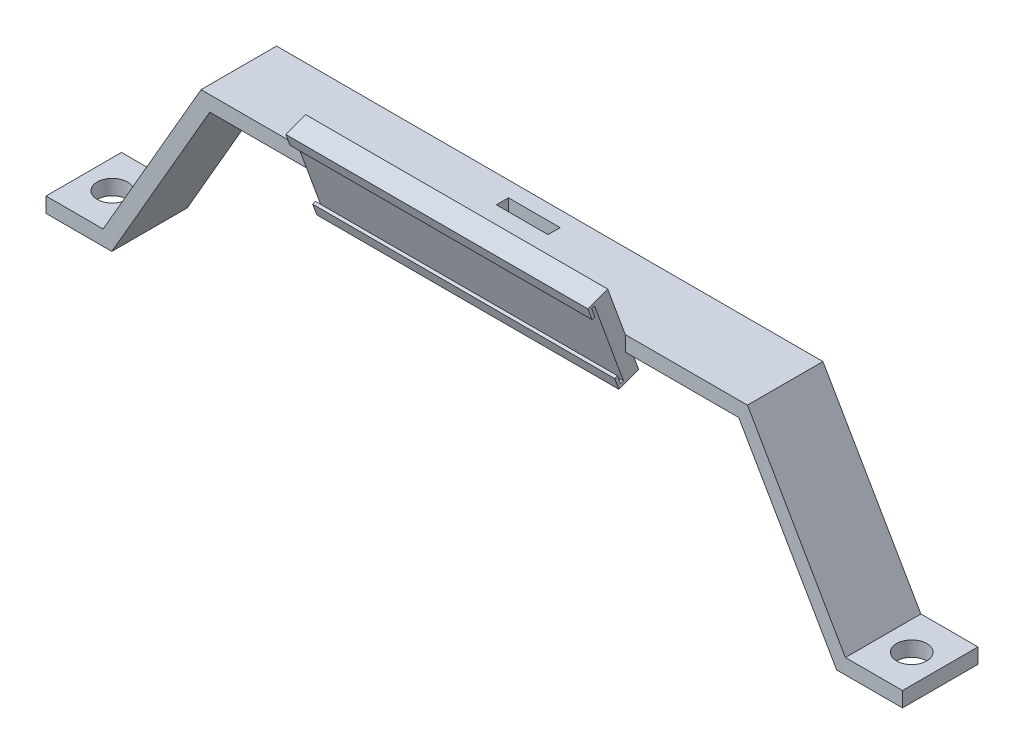
ISO-10303-21;
HEADER;
FILE_DESCRIPTION(('STEP AP214'),'2;1');
FILE_NAME('part.step','',(''),(''),'','','');
FILE_SCHEMA(('AUTOMOTIVE_DESIGN { 1 0 10303 214 1 1 1 1 }'));
ENDSEC;
DATA;
#1=APPLICATION_CONTEXT('core data for automotive mechanical design processes');
#2=APPLICATION_PROTOCOL_DEFINITION('international standard','automotive_design',2000,#1);
#3=PRODUCT_CONTEXT('',#1,'mechanical');
#4=PRODUCT('Part','Part','',(#3));
#5=PRODUCT_RELATED_PRODUCT_CATEGORY('part','',(#4));
#6=PRODUCT_DEFINITION_FORMATION('','',#4);
#7=PRODUCT_DEFINITION_CONTEXT('part definition',#1,'design');
#8=PRODUCT_DEFINITION('design','',#6,#7);
#9=PRODUCT_DEFINITION_SHAPE('','',#8);
#10=(LENGTH_UNIT() NAMED_UNIT(*) SI_UNIT(.MILLI.,.METRE.));
#11=(NAMED_UNIT(*) PLANE_ANGLE_UNIT() SI_UNIT($,.RADIAN.));
#12=(NAMED_UNIT(*) SI_UNIT($,.STERADIAN.) SOLID_ANGLE_UNIT());
#13=UNCERTAINTY_MEASURE_WITH_UNIT(LENGTH_MEASURE(1.E-05),#10,'distance_accuracy_value','');
#14=(GEOMETRIC_REPRESENTATION_CONTEXT(3) GLOBAL_UNCERTAINTY_ASSIGNED_CONTEXT((#13)) GLOBAL_UNIT_ASSIGNED_CONTEXT((#10,
#11,#12)) REPRESENTATION_CONTEXT('',''));
#15=CARTESIAN_POINT('',(0.,0.,0.));
#16=DIRECTION('',(0.,0.,1.));
#17=DIRECTION('',(1.,0.,0.));
#18=AXIS2_PLACEMENT_3D('',#15,#16,#17);
#19=CARTESIAN_POINT('',(0.,56.1666048466525,25.));
#20=DIRECTION('',(0.,1.,0.));
#21=DIRECTION('',(0.,0.,1.));
#22=AXIS2_PLACEMENT_3D('',#19,#20,#21);
#23=PLANE('',#22);
#24=DIRECTION('',(1.,0.,0.));
#25=VECTOR('',#24,1.);
#26=CARTESIAN_POINT('',(0.,56.1666048466525,9.1285851237294));
#27=LINE('',#26,#25);
#28=CARTESIAN_POINT('',(-8.54856177343624,56.1666048466525,9.1285851237294));
#29=VERTEX_POINT('',#28);
#30=CARTESIAN_POINT('',(8.54856177343624,56.1666048466525,9.1285851237294));
#31=VERTEX_POINT('',#30);
#32=EDGE_CURVE('E473',#29,#31,#27,.T.);
#33=ORIENTED_EDGE('',*,*,#32,.T.);
#34=DIRECTION('',(0.,0.,-1.));
#35=VECTOR('',#34,1.);
#36=CARTESIAN_POINT('',(8.54856177343624,56.1666048466525,25.));
#37=LINE('',#36,#35);
#38=CARTESIAN_POINT('',(8.54856177343624,56.1666048466525,5.10791466769694));
#39=VERTEX_POINT('',#38);
#40=EDGE_CURVE('E476',#31,#39,#37,.T.);
#41=ORIENTED_EDGE('',*,*,#40,.T.);
#42=DIRECTION('',(-1.,0.,0.));
#43=VECTOR('',#42,1.);
#44=CARTESIAN_POINT('',(0.,56.1666048466525,5.10791466769694));
#45=LINE('',#44,#43);
#46=CARTESIAN_POINT('',(-8.54856177343624,56.1666048466525,5.10791466769694));
#47=VERTEX_POINT('',#46);
#48=EDGE_CURVE('E465',#39,#47,#45,.T.);
#49=ORIENTED_EDGE('',*,*,#48,.T.);
#50=DIRECTION('',(0.,0.,1.));
#51=VECTOR('',#50,1.);
#52=CARTESIAN_POINT('',(-8.54856177343624,56.1666048466525,25.));
#53=LINE('',#52,#51);
#54=EDGE_CURVE('E470',#47,#29,#53,.T.);
#55=ORIENTED_EDGE('',*,*,#54,.T.);
#56=EDGE_LOOP('',(#33,#41,#49,#55));
#57=FACE_BOUND('',#56,.T.);
#58=DIRECTION('',(0.,0.,1.));
#59=VECTOR('',#58,1.);
#60=CARTESIAN_POINT('',(50.,56.1666048466525,25.));
#61=LINE('',#60,#59);
#62=CARTESIAN_POINT('',(50.,56.1666048466525,23.1801488286691));
#63=VERTEX_POINT('',#62);
#64=CARTESIAN_POINT('',(50.,56.1666048466525,25.));
#65=VERTEX_POINT('',#64);
#66=EDGE_CURVE('E50',#63,#65,#61,.T.);
#67=ORIENTED_EDGE('',*,*,#66,.F.);
#68=DIRECTION('',(1.,0.,0.));
#69=VECTOR('',#68,1.);
#70=CARTESIAN_POINT('',(0.,56.1666048466525,23.1801488286691));
#71=LINE('',#70,#69);
#72=CARTESIAN_POINT('',(-50.,56.1666048466525,23.1801488286691));
#73=VERTEX_POINT('',#72);
#74=EDGE_CURVE('E54',#73,#63,#71,.T.);
#75=ORIENTED_EDGE('',*,*,#74,.F.);
#76=DIRECTION('',(0.,0.,1.));
#77=VECTOR('',#76,1.);
#78=CARTESIAN_POINT('',(-50.,56.1666048466525,25.));
#79=LINE('',#78,#77);
#80=CARTESIAN_POINT('',(-50.,56.1666048466525,25.));
#81=VERTEX_POINT('',#80);
#82=EDGE_CURVE('E258',#73,#81,#79,.T.);
#83=ORIENTED_EDGE('',*,*,#82,.T.);
#84=DIRECTION('',(1.,0.,0.));
#85=VECTOR('',#84,1.);
#86=CARTESIAN_POINT('',(0.,56.1666048466525,25.));
#87=LINE('',#86,#85);
#88=CARTESIAN_POINT('',(-87.572195572318,56.1666048466525,25.));
#89=VERTEX_POINT('',#88);
#90=EDGE_CURVE('E396',#89,#81,#87,.T.);
#91=ORIENTED_EDGE('',*,*,#90,.F.);
#92=DIRECTION('',(0.,0.,-1.));
#93=VECTOR('',#92,1.);
#94=CARTESIAN_POINT('',(-87.572195572318,56.1666048466525,25.));
#95=LINE('',#94,#93);
#96=CARTESIAN_POINT('',(-87.572195572318,56.1666048466525,0.));
#97=VERTEX_POINT('',#96);
#98=EDGE_CURVE('E450',#89,#97,#95,.T.);
#99=ORIENTED_EDGE('',*,*,#98,.T.);
#100=DIRECTION('',(1.,0.,0.));
#101=VECTOR('',#100,1.);
#102=CARTESIAN_POINT('',(0.,56.1666048466525,0.));
#103=LINE('',#102,#101);
#104=CARTESIAN_POINT('',(87.572195572318,56.1666048466525,0.));
#105=VERTEX_POINT('',#104);
#106=EDGE_CURVE('E427',#97,#105,#103,.T.);
#107=ORIENTED_EDGE('',*,*,#106,.T.);
#108=DIRECTION('',(0.,0.,-1.));
#109=VECTOR('',#108,1.);
#110=CARTESIAN_POINT('',(87.572195572318,56.1666048466525,25.));
#111=LINE('',#110,#109);
#112=CARTESIAN_POINT('',(87.572195572318,56.1666048466525,25.));
#113=VERTEX_POINT('',#112);
#114=EDGE_CURVE('E448',#113,#105,#111,.T.);
#115=ORIENTED_EDGE('',*,*,#114,.F.);
#116=EDGE_CURVE('E395',#65,#113,#87,.T.);
#117=ORIENTED_EDGE('',*,*,#116,.F.);
#118=EDGE_LOOP('',(#67,#75,#83,#91,#99,#107,#115,#117));
#119=FACE_BOUND('',#118,.T.);
#120=ADVANCED_FACE('F35',(#57,#119),#23,.F.);
#121=CARTESIAN_POINT('',(0.,0.,25.));
#122=DIRECTION('',(0.,0.,1.));
#123=DIRECTION('',(1.,0.,0.));
#124=AXIS2_PLACEMENT_3D('',#121,#122,#123);
#125=PLANE('',#124);
#126=DIRECTION('',(1.,0.,0.));
#127=VECTOR('',#126,1.);
#128=CARTESIAN_POINT('',(0.,61.1666048466523,25.));
#129=LINE('',#128,#127);
#130=CARTESIAN_POINT('',(50.,61.1666048466523,25.));
#131=VERTEX_POINT('',#130);
#132=CARTESIAN_POINT('',(90.4589469182662,61.1666048466524,25.));
#133=VERTEX_POINT('',#132);
#134=EDGE_CURVE('E376',#131,#133,#129,.T.);
#135=ORIENTED_EDGE('',*,*,#134,.F.);
#136=DIRECTION('',(0.,-1.,0.));
#137=VECTOR('',#136,1.);
#138=CARTESIAN_POINT('',(50.,0.,25.));
#139=LINE('',#138,#137);
#140=EDGE_CURVE('E11',#131,#65,#139,.T.);
#141=ORIENTED_EDGE('',*,*,#140,.T.);
#142=ORIENTED_EDGE('',*,*,#116,.T.);
#143=DIRECTION('',(-0.499999999999998,0.86602540378444,0.));
#144=VECTOR('',#143,1.);
#145=CARTESIAN_POINT('',(90.0000000000003,51.9615242270661,25.));
#146=LINE('',#145,#144);
#147=CARTESIAN_POINT('',(120.,0.,25.));
#148=VERTEX_POINT('',#147);
#149=EDGE_CURVE('E398',#148,#113,#146,.T.);
#150=ORIENTED_EDGE('',*,*,#149,.F.);
#151=DIRECTION('',(1.,0.,0.));
#152=VECTOR('',#151,1.);
#153=CARTESIAN_POINT('',(0.,-2.59586408783657E-13,25.));
#154=LINE('',#153,#152);
#155=CARTESIAN_POINT('',(141.79346580214,0.,25.));
#156=VERTEX_POINT('',#155);
#157=EDGE_CURVE('E401',#148,#156,#154,.T.);
#158=ORIENTED_EDGE('',*,*,#157,.T.);
#159=DIRECTION('',(0.,1.,0.));
#160=VECTOR('',#159,1.);
#161=CARTESIAN_POINT('',(141.79346580214,0.,25.));
#162=LINE('',#161,#160);
#163=CARTESIAN_POINT('',(141.79346580214,5.,25.));
#164=VERTEX_POINT('',#163);
#165=EDGE_CURVE('E403',#156,#164,#162,.T.);
#166=ORIENTED_EDGE('',*,*,#165,.T.);
#167=DIRECTION('',(-1.,0.,0.));
#168=VECTOR('',#167,1.);
#169=CARTESIAN_POINT('',(0.,5.,25.));
#170=LINE('',#169,#168);
#171=CARTESIAN_POINT('',(122.886751345948,5.,25.));
#172=VERTEX_POINT('',#171);
#173=EDGE_CURVE('E405',#164,#172,#170,.T.);
#174=ORIENTED_EDGE('',*,*,#173,.T.);
#175=DIRECTION('',(0.499999999999998,-0.86602540378444,0.));
#176=VECTOR('',#175,1.);
#177=CARTESIAN_POINT('',(94.3301270189225,54.4615242270661,25.));
#178=LINE('',#177,#176);
#179=EDGE_CURVE('E373',#133,#172,#178,.T.);
#180=ORIENTED_EDGE('',*,*,#179,.F.);
#181=EDGE_LOOP('',(#135,#141,#142,#150,#158,#166,#174,#180));
#182=FACE_BOUND('',#181,.T.);
#183=ADVANCED_FACE('F502',(#182),#125,.T.);
#184=CARTESIAN_POINT('',(94.3301270189225,54.4615242270661,25.));
#185=DIRECTION('',(0.86602540378444,0.499999999999998,0.));
#186=DIRECTION('',(-0.499999999999998,0.86602540378444,0.));
#187=AXIS2_PLACEMENT_3D('',#184,#185,#186);
#188=PLANE('',#187);
#189=DIRECTION('',(0.499999999999998,-0.86602540378444,0.));
#190=VECTOR('',#189,1.);
#191=CARTESIAN_POINT('',(94.3301270189225,54.4615242270661,0.));
#192=LINE('',#191,#190);
#193=CARTESIAN_POINT('',(90.4589469182662,61.1666048466524,0.));
#194=VERTEX_POINT('',#193);
#195=CARTESIAN_POINT('',(122.886751345948,5.,0.));
#196=VERTEX_POINT('',#195);
#197=EDGE_CURVE('E372',#194,#196,#192,.T.);
#198=ORIENTED_EDGE('',*,*,#197,.F.);
#199=DIRECTION('',(0.,0.,-1.));
#200=VECTOR('',#199,1.);
#201=CARTESIAN_POINT('',(90.4589469182662,61.1666048466524,25.));
#202=LINE('',#201,#200);
#203=EDGE_CURVE('E463',#133,#194,#202,.T.);
#204=ORIENTED_EDGE('',*,*,#203,.F.);
#205=ORIENTED_EDGE('',*,*,#179,.T.);
#206=DIRECTION('',(0.,0.,-1.));
#207=VECTOR('',#206,1.);
#208=CARTESIAN_POINT('',(122.886751345948,5.,25.));
#209=LINE('',#208,#207);
#210=EDGE_CURVE('E407',#172,#196,#209,.T.);
#211=ORIENTED_EDGE('',*,*,#210,.T.);
#212=EDGE_LOOP('',(#198,#204,#205,#211));
#213=FACE_BOUND('',#212,.T.);
#214=ADVANCED_FACE('F37',(#213),#188,.T.);
#215=CARTESIAN_POINT('',(0.,61.1666048466523,25.));
#216=DIRECTION('',(0.,1.,0.));
#217=DIRECTION('',(-1.,0.,0.));
#218=AXIS2_PLACEMENT_3D('',#215,#216,#217);
#219=PLANE('',#218);
#220=DIRECTION('',(0.,0.,-1.));
#221=VECTOR('',#220,1.);
#222=CARTESIAN_POINT('',(8.54856177343624,61.1666048466523,25.));
#223=LINE('',#222,#221);
#224=CARTESIAN_POINT('',(8.54856177343624,61.1666048466523,9.1285851237294));
#225=VERTEX_POINT('',#224);
#226=CARTESIAN_POINT('',(8.54856177343624,61.1666048466523,5.10791466769694));
#227=VERTEX_POINT('',#226);
#228=EDGE_CURVE('E361',#225,#227,#223,.T.);
#229=ORIENTED_EDGE('',*,*,#228,.F.);
#230=DIRECTION('',(1.,0.,0.));
#231=VECTOR('',#230,1.);
#232=CARTESIAN_POINT('',(0.,61.1666048466523,9.1285851237294));
#233=LINE('',#232,#231);
#234=CARTESIAN_POINT('',(-8.54856177343624,61.1666048466523,9.1285851237294));
#235=VERTEX_POINT('',#234);
#236=EDGE_CURVE('E359',#235,#225,#233,.T.);
#237=ORIENTED_EDGE('',*,*,#236,.F.);
#238=DIRECTION('',(0.,0.,1.));
#239=VECTOR('',#238,1.);
#240=CARTESIAN_POINT('',(-8.54856177343624,61.1666048466523,25.));
#241=LINE('',#240,#239);
#242=CARTESIAN_POINT('',(-8.54856177343624,61.1666048466523,5.10791466769694));
#243=VERTEX_POINT('',#242);
#244=EDGE_CURVE('E357',#243,#235,#241,.T.);
#245=ORIENTED_EDGE('',*,*,#244,.F.);
#246=DIRECTION('',(-1.,0.,0.));
#247=VECTOR('',#246,1.);
#248=CARTESIAN_POINT('',(0.,61.1666048466523,5.10791466769694));
#249=LINE('',#248,#247);
#250=EDGE_CURVE('E348',#227,#243,#249,.T.);
#251=ORIENTED_EDGE('',*,*,#250,.F.);
#252=EDGE_LOOP('',(#229,#237,#245,#251));
#253=FACE_BOUND('',#252,.T.);
#254=DIRECTION('',(1.,0.,0.));
#255=VECTOR('',#254,1.);
#256=CARTESIAN_POINT('',(0.,61.1666048466523,0.));
#257=LINE('',#256,#255);
#258=CARTESIAN_POINT('',(-90.4589469182663,61.1666048466523,0.));
#259=VERTEX_POINT('',#258);
#260=EDGE_CURVE('E410',#259,#194,#257,.T.);
#261=ORIENTED_EDGE('',*,*,#260,.F.);
#262=DIRECTION('',(0.,0.,-1.));
#263=VECTOR('',#262,1.);
#264=CARTESIAN_POINT('',(-90.4589469182663,61.1666048466523,25.));
#265=LINE('',#264,#263);
#266=CARTESIAN_POINT('',(-90.4589469182663,61.1666048466523,25.));
#267=VERTEX_POINT('',#266);
#268=EDGE_CURVE('E461',#267,#259,#265,.T.);
#269=ORIENTED_EDGE('',*,*,#268,.F.);
#270=CARTESIAN_POINT('',(-50.,61.1666048466523,25.));
#271=VERTEX_POINT('',#270);
#272=EDGE_CURVE('E378',#267,#271,#129,.T.);
#273=ORIENTED_EDGE('',*,*,#272,.T.);
#274=EDGE_CURVE('E382',#271,#131,#129,.T.);
#275=ORIENTED_EDGE('',*,*,#274,.T.);
#276=ORIENTED_EDGE('',*,*,#134,.T.);
#277=ORIENTED_EDGE('',*,*,#203,.T.);
#278=EDGE_LOOP('',(#261,#269,#273,#275,#276,#277));
#279=FACE_BOUND('',#278,.T.);
#280=ADVANCED_FACE('F493',(#253,#279),#219,.T.);
#281=CARTESIAN_POINT('',(-94.3301270189225,54.4615242270661,25.));
#282=DIRECTION('',(0.86602540378444,-0.499999999999998,0.));
#283=DIRECTION('',(0.499999999999998,0.86602540378444,0.));
#284=AXIS2_PLACEMENT_3D('',#281,#282,#283);
#285=PLANE('',#284);
#286=DIRECTION('',(-0.499999999999998,-0.86602540378444,0.));
#287=VECTOR('',#286,1.);
#288=CARTESIAN_POINT('',(-94.3301270189225,54.4615242270661,0.));
#289=LINE('',#288,#287);
#290=CARTESIAN_POINT('',(-122.886751345948,5.,0.));
#291=VERTEX_POINT('',#290);
#292=EDGE_CURVE('E413',#259,#291,#289,.T.);
#293=ORIENTED_EDGE('',*,*,#292,.T.);
#294=DIRECTION('',(0.,0.,-1.));
#295=VECTOR('',#294,1.);
#296=CARTESIAN_POINT('',(-122.886751345948,5.,25.));
#297=LINE('',#296,#295);
#298=CARTESIAN_POINT('',(-122.886751345948,5.,25.));
#299=VERTEX_POINT('',#298);
#300=EDGE_CURVE('E459',#299,#291,#297,.T.);
#301=ORIENTED_EDGE('',*,*,#300,.F.);
#302=DIRECTION('',(-0.499999999999998,-0.86602540378444,0.));
#303=VECTOR('',#302,1.);
#304=CARTESIAN_POINT('',(-94.3301270189225,54.4615242270661,25.));
#305=LINE('',#304,#303);
#306=EDGE_CURVE('E381',#267,#299,#305,.T.);
#307=ORIENTED_EDGE('',*,*,#306,.F.);
#308=ORIENTED_EDGE('',*,*,#268,.T.);
#309=EDGE_LOOP('',(#293,#301,#307,#308));
#310=FACE_BOUND('',#309,.T.);
#311=ADVANCED_FACE('F517',(#310),#285,.F.);
#312=CARTESIAN_POINT('',(0.,5.,25.));
#313=DIRECTION('',(0.,1.,0.));
#314=DIRECTION('',(0.,0.,1.));
#315=AXIS2_PLACEMENT_3D('',#312,#313,#314);
#316=PLANE('',#315);
#317=CARTESIAN_POINT('',(-132.340108574044,5.,12.5));
#318=DIRECTION('',(0.,1.,0.));
#319=DIRECTION('',(0.,0.,1.));
#320=AXIS2_PLACEMENT_3D('',#317,#318,#319);
#321=CIRCLE('',#320,4.99999999999999);
#322=CARTESIAN_POINT('',(-132.340108574044,5.,17.5));
#323=VERTEX_POINT('',#322);
#324=EDGE_CURVE('E365',#323,#323,#321,.T.);
#325=ORIENTED_EDGE('',*,*,#324,.F.);
#326=EDGE_LOOP('',(#325));
#327=FACE_BOUND('',#326,.T.);
#328=DIRECTION('',(1.,0.,0.));
#329=VECTOR('',#328,1.);
#330=CARTESIAN_POINT('',(0.,5.,0.));
#331=LINE('',#330,#329);
#332=CARTESIAN_POINT('',(-141.79346580214,5.,0.));
#333=VERTEX_POINT('',#332);
#334=EDGE_CURVE('E416',#333,#291,#331,.T.);
#335=ORIENTED_EDGE('',*,*,#334,.F.);
#336=DIRECTION('',(0.,0.,-1.));
#337=VECTOR('',#336,1.);
#338=CARTESIAN_POINT('',(-141.79346580214,5.,25.));
#339=LINE('',#338,#337);
#340=CARTESIAN_POINT('',(-141.79346580214,5.,25.));
#341=VERTEX_POINT('',#340);
#342=EDGE_CURVE('E457',#341,#333,#339,.T.);
#343=ORIENTED_EDGE('',*,*,#342,.F.);
#344=DIRECTION('',(1.,0.,0.));
#345=VECTOR('',#344,1.);
#346=CARTESIAN_POINT('',(0.,5.,25.));
#347=LINE('',#346,#345);
#348=EDGE_CURVE('E384',#341,#299,#347,.T.);
#349=ORIENTED_EDGE('',*,*,#348,.T.);
#350=ORIENTED_EDGE('',*,*,#300,.T.);
#351=EDGE_LOOP('',(#335,#343,#349,#350));
#352=FACE_BOUND('',#351,.T.);
#353=ADVANCED_FACE('F552',(#327,#352),#316,.T.);
#354=CARTESIAN_POINT('',(-141.79346580214,0.,25.));
#355=DIRECTION('',(-1.,0.,0.));
#356=DIRECTION('',(0.,0.,1.));
#357=AXIS2_PLACEMENT_3D('',#354,#355,#356);
#358=PLANE('',#357);
#359=DIRECTION('',(0.,1.,0.));
#360=VECTOR('',#359,1.);
#361=CARTESIAN_POINT('',(-141.79346580214,0.,0.));
#362=LINE('',#361,#360);
#363=CARTESIAN_POINT('',(-141.79346580214,0.,0.));
#364=VERTEX_POINT('',#363);
#365=EDGE_CURVE('E419',#364,#333,#362,.T.);
#366=ORIENTED_EDGE('',*,*,#365,.F.);
#367=DIRECTION('',(0.,0.,-1.));
#368=VECTOR('',#367,1.);
#369=CARTESIAN_POINT('',(-141.79346580214,0.,25.));
#370=LINE('',#369,#368);
#371=CARTESIAN_POINT('',(-141.79346580214,0.,25.));
#372=VERTEX_POINT('',#371);
#373=EDGE_CURVE('E455',#372,#364,#370,.T.);
#374=ORIENTED_EDGE('',*,*,#373,.F.);
#375=DIRECTION('',(0.,1.,0.));
#376=VECTOR('',#375,1.);
#377=CARTESIAN_POINT('',(-141.79346580214,0.,25.));
#378=LINE('',#377,#376);
#379=EDGE_CURVE('E387',#372,#341,#378,.T.);
#380=ORIENTED_EDGE('',*,*,#379,.T.);
#381=ORIENTED_EDGE('',*,*,#342,.T.);
#382=EDGE_LOOP('',(#366,#374,#380,#381));
#383=FACE_BOUND('',#382,.T.);
#384=ADVANCED_FACE('F524',(#383),#358,.T.);
#385=CARTESIAN_POINT('',(0.,0.,25.));
#386=DIRECTION('',(0.,-1.,0.));
#387=DIRECTION('',(1.,0.,0.));
#388=AXIS2_PLACEMENT_3D('',#385,#386,#387);
#389=PLANE('',#388);
#390=CARTESIAN_POINT('',(-132.340108574044,0.,12.5));
#391=DIRECTION('',(0.,-1.,0.));
#392=DIRECTION('',(1.,0.,0.));
#393=AXIS2_PLACEMENT_3D('',#390,#391,#392);
#394=CIRCLE('',#393,4.99999999999999);
#395=CARTESIAN_POINT('',(-127.340108574044,0.,12.5));
#396=VERTEX_POINT('',#395);
#397=EDGE_CURVE('E364',#396,#396,#394,.T.);
#398=ORIENTED_EDGE('',*,*,#397,.F.);
#399=EDGE_LOOP('',(#398));
#400=FACE_BOUND('',#399,.T.);
#401=DIRECTION('',(-1.,0.,0.));
#402=VECTOR('',#401,1.);
#403=CARTESIAN_POINT('',(0.,0.,0.));
#404=LINE('',#403,#402);
#405=CARTESIAN_POINT('',(-120.,0.,0.));
#406=VERTEX_POINT('',#405);
#407=EDGE_CURVE('E422',#406,#364,#404,.T.);
#408=ORIENTED_EDGE('',*,*,#407,.F.);
#409=DIRECTION('',(0.,0.,-1.));
#410=VECTOR('',#409,1.);
#411=CARTESIAN_POINT('',(-120.,0.,25.));
#412=LINE('',#411,#410);
#413=CARTESIAN_POINT('',(-120.,0.,25.));
#414=VERTEX_POINT('',#413);
#415=EDGE_CURVE('E453',#414,#406,#412,.T.);
#416=ORIENTED_EDGE('',*,*,#415,.F.);
#417=DIRECTION('',(-1.,0.,0.));
#418=VECTOR('',#417,1.);
#419=CARTESIAN_POINT('',(0.,0.,25.));
#420=LINE('',#419,#418);
#421=EDGE_CURVE('E390',#414,#372,#420,.T.);
#422=ORIENTED_EDGE('',*,*,#421,.T.);
#423=ORIENTED_EDGE('',*,*,#373,.T.);
#424=EDGE_LOOP('',(#408,#416,#422,#423));
#425=FACE_BOUND('',#424,.T.);
#426=ADVANCED_FACE('F527',(#400,#425),#389,.T.);
#427=CARTESIAN_POINT('',(-90.0000000000003,51.9615242270661,25.));
#428=DIRECTION('',(-0.86602540378444,0.499999999999998,0.));
#429=DIRECTION('',(-0.499999999999998,-0.86602540378444,0.));
#430=AXIS2_PLACEMENT_3D('',#427,#428,#429);
#431=PLANE('',#430);
#432=DIRECTION('',(0.499999999999998,0.86602540378444,0.));
#433=VECTOR('',#432,1.);
#434=CARTESIAN_POINT('',(-90.0000000000003,51.9615242270661,0.));
#435=LINE('',#434,#433);
#436=EDGE_CURVE('E425',#406,#97,#435,.T.);
#437=ORIENTED_EDGE('',*,*,#436,.T.);
#438=ORIENTED_EDGE('',*,*,#98,.F.);
#439=DIRECTION('',(0.499999999999998,0.86602540378444,0.));
#440=VECTOR('',#439,1.);
#441=CARTESIAN_POINT('',(-90.0000000000003,51.9615242270661,25.));
#442=LINE('',#441,#440);
#443=EDGE_CURVE('E393',#414,#89,#442,.T.);
#444=ORIENTED_EDGE('',*,*,#443,.F.);
#445=ORIENTED_EDGE('',*,*,#415,.T.);
#446=EDGE_LOOP('',(#437,#438,#444,#445));
#447=FACE_BOUND('',#446,.T.);
#448=ADVANCED_FACE('F531',(#447),#431,.F.);
#449=CARTESIAN_POINT('',(90.0000000000003,51.9615242270661,25.));
#450=DIRECTION('',(-0.86602540378444,-0.499999999999998,0.));
#451=DIRECTION('',(0.499999999999998,-0.86602540378444,0.));
#452=AXIS2_PLACEMENT_3D('',#449,#450,#451);
#453=PLANE('',#452);
#454=DIRECTION('',(-0.499999999999998,0.86602540378444,0.));
#455=VECTOR('',#454,1.);
#456=CARTESIAN_POINT('',(90.0000000000003,51.9615242270661,0.));
#457=LINE('',#456,#455);
#458=CARTESIAN_POINT('',(120.,0.,0.));
#459=VERTEX_POINT('',#458);
#460=EDGE_CURVE('E430',#459,#105,#457,.T.);
#461=ORIENTED_EDGE('',*,*,#460,.F.);
#462=DIRECTION('',(0.,0.,-1.));
#463=VECTOR('',#462,1.);
#464=CARTESIAN_POINT('',(120.,0.,25.));
#465=LINE('',#464,#463);
#466=EDGE_CURVE('E446',#148,#459,#465,.T.);
#467=ORIENTED_EDGE('',*,*,#466,.F.);
#468=ORIENTED_EDGE('',*,*,#149,.T.);
#469=ORIENTED_EDGE('',*,*,#114,.T.);
#470=EDGE_LOOP('',(#461,#467,#468,#469));
#471=FACE_BOUND('',#470,.T.);
#472=ADVANCED_FACE('F543',(#471),#453,.T.);
#473=CARTESIAN_POINT('',(0.,-2.59586408783657E-13,25.));
#474=DIRECTION('',(0.,1.,0.));
#475=DIRECTION('',(-1.,0.,0.));
#476=AXIS2_PLACEMENT_3D('',#473,#474,#475);
#477=PLANE('',#476);
#478=CARTESIAN_POINT('',(132.340108574044,0.,12.5));
#479=DIRECTION('',(0.,1.,0.));
#480=DIRECTION('',(-1.,0.,0.));
#481=AXIS2_PLACEMENT_3D('',#478,#479,#480);
#482=CIRCLE('',#481,4.99999999999999);
#483=CARTESIAN_POINT('',(127.340108574044,0.,12.5));
#484=VERTEX_POINT('',#483);
#485=EDGE_CURVE('E369',#484,#484,#482,.T.);
#486=ORIENTED_EDGE('',*,*,#485,.T.);
#487=EDGE_LOOP('',(#486));
#488=FACE_BOUND('',#487,.T.);
#489=DIRECTION('',(1.,0.,0.));
#490=VECTOR('',#489,1.);
#491=CARTESIAN_POINT('',(0.,-2.59586408783657E-13,0.));
#492=LINE('',#491,#490);
#493=CARTESIAN_POINT('',(141.79346580214,0.,0.));
#494=VERTEX_POINT('',#493);
#495=EDGE_CURVE('E433',#459,#494,#492,.T.);
#496=ORIENTED_EDGE('',*,*,#495,.T.);
#497=DIRECTION('',(0.,0.,-1.));
#498=VECTOR('',#497,1.);
#499=CARTESIAN_POINT('',(141.79346580214,0.,25.));
#500=LINE('',#499,#498);
#501=EDGE_CURVE('E443',#156,#494,#500,.T.);
#502=ORIENTED_EDGE('',*,*,#501,.F.);
#503=ORIENTED_EDGE('',*,*,#157,.F.);
#504=ORIENTED_EDGE('',*,*,#466,.T.);
#505=EDGE_LOOP('',(#496,#502,#503,#504));
#506=FACE_BOUND('',#505,.T.);
#507=ADVANCED_FACE('F605',(#488,#506),#477,.F.);
#508=CARTESIAN_POINT('',(141.79346580214,0.,25.));
#509=DIRECTION('',(-1.,0.,0.));
#510=DIRECTION('',(0.,0.,1.));
#511=AXIS2_PLACEMENT_3D('',#508,#509,#510);
#512=PLANE('',#511);
#513=DIRECTION('',(0.,1.,0.));
#514=VECTOR('',#513,1.);
#515=CARTESIAN_POINT('',(141.79346580214,0.,0.));
#516=LINE('',#515,#514);
#517=CARTESIAN_POINT('',(141.79346580214,5.,0.));
#518=VERTEX_POINT('',#517);
#519=EDGE_CURVE('E435',#494,#518,#516,.T.);
#520=ORIENTED_EDGE('',*,*,#519,.T.);
#521=DIRECTION('',(0.,0.,-1.));
#522=VECTOR('',#521,1.);
#523=CARTESIAN_POINT('',(141.79346580214,5.,25.));
#524=LINE('',#523,#522);
#525=EDGE_CURVE('E440',#164,#518,#524,.T.);
#526=ORIENTED_EDGE('',*,*,#525,.F.);
#527=ORIENTED_EDGE('',*,*,#165,.F.);
#528=ORIENTED_EDGE('',*,*,#501,.T.);
#529=EDGE_LOOP('',(#520,#526,#527,#528));
#530=FACE_BOUND('',#529,.T.);
#531=ADVANCED_FACE('F602',(#530),#512,.F.);
#532=CARTESIAN_POINT('',(0.,5.,25.));
#533=DIRECTION('',(0.,-1.,0.));
#534=DIRECTION('',(0.,0.,-1.));
#535=AXIS2_PLACEMENT_3D('',#532,#533,#534);
#536=PLANE('',#535);
#537=CARTESIAN_POINT('',(132.340108574044,5.,12.5));
#538=DIRECTION('',(0.,-1.,0.));
#539=DIRECTION('',(0.,0.,-1.));
#540=AXIS2_PLACEMENT_3D('',#537,#538,#539);
#541=CIRCLE('',#540,4.99999999999999);
#542=CARTESIAN_POINT('',(132.340108574044,5.,7.50000000000001));
#543=VERTEX_POINT('',#542);
#544=EDGE_CURVE('E368',#543,#543,#541,.T.);
#545=ORIENTED_EDGE('',*,*,#544,.T.);
#546=EDGE_LOOP('',(#545));
#547=FACE_BOUND('',#546,.T.);
#548=DIRECTION('',(-1.,0.,0.));
#549=VECTOR('',#548,1.);
#550=CARTESIAN_POINT('',(0.,5.,0.));
#551=LINE('',#550,#549);
#552=EDGE_CURVE('E377',#518,#196,#551,.T.);
#553=ORIENTED_EDGE('',*,*,#552,.T.);
#554=ORIENTED_EDGE('',*,*,#210,.F.);
#555=ORIENTED_EDGE('',*,*,#173,.F.);
#556=ORIENTED_EDGE('',*,*,#525,.T.);
#557=EDGE_LOOP('',(#553,#554,#555,#556));
#558=FACE_BOUND('',#557,.T.);
#559=ADVANCED_FACE('F508',(#547,#558),#536,.F.);
#560=DIRECTION('',(0.,-1.,0.));
#561=VECTOR('',#560,1.);
#562=CARTESIAN_POINT('',(-50.,0.,25.));
#563=LINE('',#562,#561);
#564=EDGE_CURVE('E43',#271,#81,#563,.T.);
#565=ORIENTED_EDGE('',*,*,#564,.F.);
#566=ORIENTED_EDGE('',*,*,#272,.F.);
#567=ORIENTED_EDGE('',*,*,#306,.T.);
#568=ORIENTED_EDGE('',*,*,#348,.F.);
#569=ORIENTED_EDGE('',*,*,#379,.F.);
#570=ORIENTED_EDGE('',*,*,#421,.F.);
#571=ORIENTED_EDGE('',*,*,#443,.T.);
#572=ORIENTED_EDGE('',*,*,#90,.T.);
#573=EDGE_LOOP('',(#565,#566,#567,#568,#569,#570,#571,#572));
#574=FACE_BOUND('',#573,.T.);
#575=ADVANCED_FACE('F487',(#574),#125,.T.);
#576=CARTESIAN_POINT('',(0.,0.,0.));
#577=DIRECTION('',(0.,0.,1.));
#578=DIRECTION('',(1.,0.,0.));
#579=AXIS2_PLACEMENT_3D('',#576,#577,#578);
#580=PLANE('',#579);
#581=ORIENTED_EDGE('',*,*,#197,.T.);
#582=ORIENTED_EDGE('',*,*,#552,.F.);
#583=ORIENTED_EDGE('',*,*,#519,.F.);
#584=ORIENTED_EDGE('',*,*,#495,.F.);
#585=ORIENTED_EDGE('',*,*,#460,.T.);
#586=ORIENTED_EDGE('',*,*,#106,.F.);
#587=ORIENTED_EDGE('',*,*,#436,.F.);
#588=ORIENTED_EDGE('',*,*,#407,.T.);
#589=ORIENTED_EDGE('',*,*,#365,.T.);
#590=ORIENTED_EDGE('',*,*,#334,.T.);
#591=ORIENTED_EDGE('',*,*,#292,.F.);
#592=ORIENTED_EDGE('',*,*,#260,.T.);
#593=EDGE_LOOP('',(#581,#582,#583,#584,#585,#586,#587,#588,#589,#590,#591,#592));
#594=FACE_BOUND('',#593,.T.);
#595=ADVANCED_FACE('F512',(#594),#580,.F.);
#596=CARTESIAN_POINT('',(132.340108574044,-95.,12.5));
#597=DIRECTION('',(0.,1.,0.));
#598=DIRECTION('',(0.,0.,1.));
#599=AXIS2_PLACEMENT_3D('',#596,#597,#598);
#600=CYLINDRICAL_SURFACE('',#599,4.99999999999999);
#601=ORIENTED_EDGE('',*,*,#544,.F.);
#602=EDGE_LOOP('',(#601));
#603=FACE_BOUND('',#602,.T.);
#604=ORIENTED_EDGE('',*,*,#485,.F.);
#605=EDGE_LOOP('',(#604));
#606=FACE_BOUND('',#605,.T.);
#607=ADVANCED_FACE('F593',(#603,#606),#600,.F.);
#608=CARTESIAN_POINT('',(8.54856177343624,-95.,9.1285851237294));
#609=DIRECTION('',(1.,0.,0.));
#610=DIRECTION('',(0.,0.,-1.));
#611=AXIS2_PLACEMENT_3D('',#608,#609,#610);
#612=PLANE('',#611);
#613=ORIENTED_EDGE('',*,*,#228,.T.);
#614=DIRECTION('',(0.,1.,0.));
#615=VECTOR('',#614,1.);
#616=CARTESIAN_POINT('',(8.54856177343624,-95.,5.10791466769694));
#617=LINE('',#616,#615);
#618=EDGE_CURVE('E344',#39,#227,#617,.T.);
#619=ORIENTED_EDGE('',*,*,#618,.F.);
#620=ORIENTED_EDGE('',*,*,#40,.F.);
#621=DIRECTION('',(0.,1.,0.));
#622=VECTOR('',#621,1.);
#623=CARTESIAN_POINT('',(8.54856177343624,-95.,9.1285851237294));
#624=LINE('',#623,#622);
#625=EDGE_CURVE('E345',#31,#225,#624,.T.);
#626=ORIENTED_EDGE('',*,*,#625,.T.);
#627=EDGE_LOOP('',(#613,#619,#620,#626));
#628=FACE_BOUND('',#627,.T.);
#629=ADVANCED_FACE('F568',(#628),#612,.F.);
#630=CARTESIAN_POINT('',(-8.54856177343624,-95.,9.1285851237294));
#631=DIRECTION('',(0.,0.,1.));
#632=DIRECTION('',(1.,0.,0.));
#633=AXIS2_PLACEMENT_3D('',#630,#631,#632);
#634=PLANE('',#633);
#635=ORIENTED_EDGE('',*,*,#236,.T.);
#636=ORIENTED_EDGE('',*,*,#625,.F.);
#637=ORIENTED_EDGE('',*,*,#32,.F.);
#638=DIRECTION('',(0.,1.,0.));
#639=VECTOR('',#638,1.);
#640=CARTESIAN_POINT('',(-8.54856177343624,-95.,9.1285851237294));
#641=LINE('',#640,#639);
#642=EDGE_CURVE('E349',#29,#235,#641,.T.);
#643=ORIENTED_EDGE('',*,*,#642,.T.);
#644=EDGE_LOOP('',(#635,#636,#637,#643));
#645=FACE_BOUND('',#644,.T.);
#646=ADVANCED_FACE('F571',(#645),#634,.F.);
#647=CARTESIAN_POINT('',(-8.54856177343624,-95.,9.1285851237294));
#648=DIRECTION('',(-1.,0.,0.));
#649=DIRECTION('',(0.,0.,1.));
#650=AXIS2_PLACEMENT_3D('',#647,#648,#649);
#651=PLANE('',#650);
#652=ORIENTED_EDGE('',*,*,#244,.T.);
#653=ORIENTED_EDGE('',*,*,#642,.F.);
#654=ORIENTED_EDGE('',*,*,#54,.F.);
#655=DIRECTION('',(0.,1.,0.));
#656=VECTOR('',#655,1.);
#657=CARTESIAN_POINT('',(-8.54856177343624,-95.,5.10791466769694));
#658=LINE('',#657,#656);
#659=EDGE_CURVE('E352',#47,#243,#658,.T.);
#660=ORIENTED_EDGE('',*,*,#659,.T.);
#661=EDGE_LOOP('',(#652,#653,#654,#660));
#662=FACE_BOUND('',#661,.T.);
#663=ADVANCED_FACE('F575',(#662),#651,.F.);
#664=CARTESIAN_POINT('',(-8.54856177343624,-95.,5.10791466769694));
#665=DIRECTION('',(0.,0.,-1.));
#666=DIRECTION('',(-1.,0.,0.));
#667=AXIS2_PLACEMENT_3D('',#664,#665,#666);
#668=PLANE('',#667);
#669=ORIENTED_EDGE('',*,*,#250,.T.);
#670=ORIENTED_EDGE('',*,*,#659,.F.);
#671=ORIENTED_EDGE('',*,*,#48,.F.);
#672=ORIENTED_EDGE('',*,*,#618,.T.);
#673=EDGE_LOOP('',(#669,#670,#671,#672));
#674=FACE_BOUND('',#673,.T.);
#675=ADVANCED_FACE('F577',(#674),#668,.F.);
#676=CARTESIAN_POINT('',(-132.340108574044,-95.,12.5));
#677=DIRECTION('',(0.,1.,0.));
#678=DIRECTION('',(0.,0.,1.));
#679=AXIS2_PLACEMENT_3D('',#676,#677,#678);
#680=CYLINDRICAL_SURFACE('',#679,4.99999999999999);
#681=ORIENTED_EDGE('',*,*,#324,.T.);
#682=EDGE_LOOP('',(#681));
#683=FACE_BOUND('',#682,.T.);
#684=ORIENTED_EDGE('',*,*,#397,.T.);
#685=EDGE_LOOP('',(#684));
#686=FACE_BOUND('',#685,.T.);
#687=ADVANCED_FACE('F579',(#683,#686),#680,.F.);
#688=CARTESIAN_POINT('',(50.,77.1252683722117,30.8084785019733));
#689=DIRECTION('',(0.,-0.342020143325666,0.939692620785909));
#690=DIRECTION('',(0.,-0.939692620785909,-0.342020143325666));
#691=AXIS2_PLACEMENT_3D('',#688,#689,#690);
#692=PLANE('',#691);
#693=DIRECTION('',(0.,0.939692620785909,0.342020143325666));
#694=VECTOR('',#693,1.);
#695=CARTESIAN_POINT('',(-50.,77.1252683722117,30.8084785019733));
#696=LINE('',#695,#694);
#697=CARTESIAN_POINT('',(-50.,48.9344897486345,20.5478742022033));
#698=VERTEX_POINT('',#697);
#699=EDGE_CURVE('E249',#698,#73,#696,.T.);
#700=ORIENTED_EDGE('',*,*,#699,.T.);
#701=ORIENTED_EDGE('',*,*,#74,.T.);
#702=DIRECTION('',(0.,0.939692620785909,0.342020143325666));
#703=VECTOR('',#702,1.);
#704=CARTESIAN_POINT('',(50.,77.1252683722117,30.8084785019733));
#705=LINE('',#704,#703);
#706=CARTESIAN_POINT('',(50.,48.9344897486345,20.5478742022033));
#707=VERTEX_POINT('',#706);
#708=EDGE_CURVE('E284',#707,#63,#705,.T.);
#709=ORIENTED_EDGE('',*,*,#708,.F.);
#710=DIRECTION('',(-1.,0.,0.));
#711=VECTOR('',#710,1.);
#712=CARTESIAN_POINT('',(50.,48.9344897486345,20.5478742022033));
#713=LINE('',#712,#711);
#714=EDGE_CURVE('E313',#707,#698,#713,.T.);
#715=ORIENTED_EDGE('',*,*,#714,.T.);
#716=EDGE_LOOP('',(#700,#701,#709,#715));
#717=FACE_BOUND('',#716,.T.);
#718=ADVANCED_FACE('F585',(#717),#692,.F.);
#719=CARTESIAN_POINT('',(50.,0.,0.));
#720=DIRECTION('',(-1.,0.,0.));
#721=DIRECTION('',(0.,0.,1.));
#722=AXIS2_PLACEMENT_3D('',#719,#720,#721);
#723=PLANE('',#722);
#724=ORIENTED_EDGE('',*,*,#708,.T.);
#725=ORIENTED_EDGE('',*,*,#66,.T.);
#726=ORIENTED_EDGE('',*,*,#140,.F.);
#727=CARTESIAN_POINT('',(50.,77.1252683722117,30.8084785019733));
#728=VERTEX_POINT('',#727);
#729=EDGE_CURVE('E245',#131,#728,#705,.T.);
#730=ORIENTED_EDGE('',*,*,#729,.T.);
#731=DIRECTION('',(0.,-0.342020143325666,0.939692620785909));
#732=VECTOR('',#731,1.);
#733=CARTESIAN_POINT('',(50.,75.4151676555834,35.5069416059029));
#734=LINE('',#733,#732);
#735=CARTESIAN_POINT('',(50.,74.7311273689321,37.3863268474747));
#736=VERTEX_POINT('',#735);
#737=EDGE_CURVE('E236',#728,#736,#734,.T.);
#738=ORIENTED_EDGE('',*,*,#737,.T.);
#739=DIRECTION('',(0.,-0.93969262078591,-0.342020143325665));
#740=VECTOR('',#739,1.);
#741=CARTESIAN_POINT('',(50.,74.7311273689321,37.3863268474747));
#742=LINE('',#741,#740);
#743=CARTESIAN_POINT('',(50.,70.9723568857884,36.018246274172));
#744=VERTEX_POINT('',#743);
#745=EDGE_CURVE('E241',#736,#744,#742,.T.);
#746=ORIENTED_EDGE('',*,*,#745,.T.);
#747=DIRECTION('',(0.,0.342020143325669,-0.939692620785908));
#748=VECTOR('',#747,1.);
#749=CARTESIAN_POINT('',(50.,70.9723568857884,36.018246274172));
#750=LINE('',#749,#748);
#751=CARTESIAN_POINT('',(50.,71.3143770291141,35.078553653386));
#752=VERTEX_POINT('',#751);
#753=EDGE_CURVE('E264',#744,#752,#750,.T.);
#754=ORIENTED_EDGE('',*,*,#753,.T.);
#755=DIRECTION('',(0.,0.93969262078587,0.342020143325774));
#756=VECTOR('',#755,1.);
#757=CARTESIAN_POINT('',(50.,71.3143770291141,35.078553653386));
#758=LINE('',#757,#756);
#759=CARTESIAN_POINT('',(50.,74.1334548914717,36.1046140833634));
#760=VERTEX_POINT('',#759);
#761=EDGE_CURVE('E266',#752,#760,#758,.T.);
#762=ORIENTED_EDGE('',*,*,#761,.T.);
#763=DIRECTION('',(0.,0.342020143325669,-0.939692620785908));
#764=VECTOR('',#763,1.);
#765=CARTESIAN_POINT('',(50.,74.1334548914717,36.1046140833634));
#766=LINE('',#765,#764);
#767=CARTESIAN_POINT('',(50.,74.4754750347974,35.1649214625774));
#768=VERTEX_POINT('',#767);
#769=EDGE_CURVE('E270',#760,#768,#766,.T.);
#770=ORIENTED_EDGE('',*,*,#769,.T.);
#771=DIRECTION('',(0.,-0.939692620785909,-0.342020143325666));
#772=VECTOR('',#771,1.);
#773=CARTESIAN_POINT('',(50.,74.4754750347974,35.1649214625774));
#774=LINE('',#773,#772);
#775=CARTESIAN_POINT('',(50.,48.164081652792,25.5883574494588));
#776=VERTEX_POINT('',#775);
#777=EDGE_CURVE('E272',#768,#776,#774,.T.);
#778=ORIENTED_EDGE('',*,*,#777,.T.);
#779=DIRECTION('',(0.,-0.34202014332569,0.939692620785901));
#780=VECTOR('',#779,1.);
#781=CARTESIAN_POINT('',(50.,47.8220615094664,26.5280500702444));
#782=LINE('',#781,#780);
#783=CARTESIAN_POINT('',(50.,47.8220615094664,26.5280500702444));
#784=VERTEX_POINT('',#783);
#785=EDGE_CURVE('E274',#776,#784,#782,.T.);
#786=ORIENTED_EDGE('',*,*,#785,.T.);
#787=DIRECTION('',(0.,0.93969262078587,0.342020143325775));
#788=VECTOR('',#787,1.);
#789=CARTESIAN_POINT('',(50.,50.641139371824,27.5541105002217));
#790=LINE('',#789,#788);
#791=CARTESIAN_POINT('',(50.,50.641139371824,27.5541105002217));
#792=VERTEX_POINT('',#791);
#793=EDGE_CURVE('E276',#784,#792,#790,.T.);
#794=ORIENTED_EDGE('',*,*,#793,.T.);
#795=DIRECTION('',(0.,-0.342020143325669,0.939692620785908));
#796=VECTOR('',#795,1.);
#797=CARTESIAN_POINT('',(50.,50.2991192284983,28.4938031210076));
#798=LINE('',#797,#796);
#799=CARTESIAN_POINT('',(50.,50.2991192284983,28.4938031210076));
#800=VERTEX_POINT('',#799);
#801=EDGE_CURVE('E278',#792,#800,#798,.T.);
#802=ORIENTED_EDGE('',*,*,#801,.T.);
#803=DIRECTION('',(0.,-0.939692620785909,-0.342020143325666));
#804=VECTOR('',#803,1.);
#805=CARTESIAN_POINT('',(50.,46.5403487453547,27.1257225477049));
#806=LINE('',#805,#804);
#807=CARTESIAN_POINT('',(50.,46.5403487453547,27.1257225477049));
#808=VERTEX_POINT('',#807);
#809=EDGE_CURVE('E280',#800,#808,#806,.T.);
#810=ORIENTED_EDGE('',*,*,#809,.T.);
#811=DIRECTION('',(0.,0.342020143325667,-0.939692620785909));
#812=VECTOR('',#811,1.);
#813=CARTESIAN_POINT('',(50.,47.2243890320061,25.246337306133));
#814=LINE('',#813,#812);
#815=EDGE_CURVE('E282',#808,#707,#814,.T.);
#816=ORIENTED_EDGE('',*,*,#815,.T.);
#817=EDGE_LOOP('',(#724,#725,#726,#730,#738,#746,#754,#762,#770,#778,#786,#794,#802,#810,#816));
#818=FACE_BOUND('',#817,.T.);
#819=ADVANCED_FACE('F239',(#818),#723,.F.);
#820=CARTESIAN_POINT('',(-50.,0.,0.));
#821=DIRECTION('',(-1.,0.,0.));
#822=DIRECTION('',(0.,0.,1.));
#823=AXIS2_PLACEMENT_3D('',#820,#821,#822);
#824=PLANE('',#823);
#825=ORIENTED_EDGE('',*,*,#82,.F.);
#826=ORIENTED_EDGE('',*,*,#699,.F.);
#827=DIRECTION('',(0.,0.342020143325665,-0.93969262078591));
#828=VECTOR('',#827,1.);
#829=CARTESIAN_POINT('',(-50.,47.2243890320061,25.246337306133));
#830=LINE('',#829,#828);
#831=CARTESIAN_POINT('',(-50.,46.5403487453547,27.1257225477049));
#832=VERTEX_POINT('',#831);
#833=EDGE_CURVE('E307',#832,#698,#830,.T.);
#834=ORIENTED_EDGE('',*,*,#833,.F.);
#835=DIRECTION('',(0.,-0.939692620785909,-0.342020143325666));
#836=VECTOR('',#835,1.);
#837=CARTESIAN_POINT('',(-50.,46.5403487453547,27.1257225477049));
#838=LINE('',#837,#836);
#839=CARTESIAN_POINT('',(-50.,50.2991192284983,28.4938031210076));
#840=VERTEX_POINT('',#839);
#841=EDGE_CURVE('E304',#840,#832,#838,.T.);
#842=ORIENTED_EDGE('',*,*,#841,.F.);
#843=DIRECTION('',(0.,-0.342020143325669,0.939692620785908));
#844=VECTOR('',#843,1.);
#845=CARTESIAN_POINT('',(-50.,50.2991192284983,28.4938031210076));
#846=LINE('',#845,#844);
#847=CARTESIAN_POINT('',(-50.,50.641139371824,27.5541105002217));
#848=VERTEX_POINT('',#847);
#849=EDGE_CURVE('E302',#848,#840,#846,.T.);
#850=ORIENTED_EDGE('',*,*,#849,.F.);
#851=DIRECTION('',(0.,0.93969262078587,0.342020143325775));
#852=VECTOR('',#851,1.);
#853=CARTESIAN_POINT('',(-50.,50.641139371824,27.5541105002217));
#854=LINE('',#853,#852);
#855=CARTESIAN_POINT('',(-50.,47.8220615094664,26.5280500702444));
#856=VERTEX_POINT('',#855);
#857=EDGE_CURVE('E300',#856,#848,#854,.T.);
#858=ORIENTED_EDGE('',*,*,#857,.F.);
#859=DIRECTION('',(0.,-0.34202014332569,0.939692620785901));
#860=VECTOR('',#859,1.);
#861=CARTESIAN_POINT('',(-50.,47.8220615094664,26.5280500702444));
#862=LINE('',#861,#860);
#863=CARTESIAN_POINT('',(-50.,48.164081652792,25.5883574494588));
#864=VERTEX_POINT('',#863);
#865=EDGE_CURVE('E298',#864,#856,#862,.T.);
#866=ORIENTED_EDGE('',*,*,#865,.F.);
#867=DIRECTION('',(0.,-0.939692620785909,-0.342020143325666));
#868=VECTOR('',#867,1.);
#869=CARTESIAN_POINT('',(-50.,74.4754750347974,35.1649214625774));
#870=LINE('',#869,#868);
#871=CARTESIAN_POINT('',(-50.,74.4754750347974,35.1649214625774));
#872=VERTEX_POINT('',#871);
#873=EDGE_CURVE('E296',#872,#864,#870,.T.);
#874=ORIENTED_EDGE('',*,*,#873,.F.);
#875=DIRECTION('',(0.,0.342020143325669,-0.939692620785908));
#876=VECTOR('',#875,1.);
#877=CARTESIAN_POINT('',(-50.,74.1334548914717,36.1046140833634));
#878=LINE('',#877,#876);
#879=CARTESIAN_POINT('',(-50.,74.1334548914717,36.1046140833634));
#880=VERTEX_POINT('',#879);
#881=EDGE_CURVE('E294',#880,#872,#878,.T.);
#882=ORIENTED_EDGE('',*,*,#881,.F.);
#883=DIRECTION('',(0.,0.93969262078587,0.342020143325774));
#884=VECTOR('',#883,1.);
#885=CARTESIAN_POINT('',(-50.,71.3143770291141,35.078553653386));
#886=LINE('',#885,#884);
#887=CARTESIAN_POINT('',(-50.,71.3143770291141,35.078553653386));
#888=VERTEX_POINT('',#887);
#889=EDGE_CURVE('E292',#888,#880,#886,.T.);
#890=ORIENTED_EDGE('',*,*,#889,.F.);
#891=DIRECTION('',(0.,0.342020143325669,-0.939692620785908));
#892=VECTOR('',#891,1.);
#893=CARTESIAN_POINT('',(-50.,70.9723568857884,36.018246274172));
#894=LINE('',#893,#892);
#895=CARTESIAN_POINT('',(-50.,70.9723568857884,36.018246274172));
#896=VERTEX_POINT('',#895);
#897=EDGE_CURVE('E290',#896,#888,#894,.T.);
#898=ORIENTED_EDGE('',*,*,#897,.F.);
#899=DIRECTION('',(0.,-0.93969262078591,-0.342020143325665));
#900=VECTOR('',#899,1.);
#901=CARTESIAN_POINT('',(-50.,74.7311273689321,37.3863268474747));
#902=LINE('',#901,#900);
#903=CARTESIAN_POINT('',(-50.,74.7311273689321,37.3863268474747));
#904=VERTEX_POINT('',#903);
#905=EDGE_CURVE('E288',#904,#896,#902,.T.);
#906=ORIENTED_EDGE('',*,*,#905,.F.);
#907=DIRECTION('',(0.,-0.342020143325669,0.939692620785908));
#908=VECTOR('',#907,1.);
#909=CARTESIAN_POINT('',(-50.,75.4151676555834,35.5069416059029));
#910=LINE('',#909,#908);
#911=CARTESIAN_POINT('',(-50.,77.1252683722117,30.8084785019733));
#912=VERTEX_POINT('',#911);
#913=EDGE_CURVE('E255',#912,#904,#910,.T.);
#914=ORIENTED_EDGE('',*,*,#913,.F.);
#915=EDGE_CURVE('E309',#271,#912,#696,.T.);
#916=ORIENTED_EDGE('',*,*,#915,.F.);
#917=ORIENTED_EDGE('',*,*,#564,.T.);
#918=EDGE_LOOP('',(#825,#826,#834,#842,#850,#858,#866,#874,#882,#890,#898,#906,#914,#916,#917));
#919=FACE_BOUND('',#918,.T.);
#920=ADVANCED_FACE('F483',(#919),#824,.T.);
#921=CARTESIAN_POINT('',(50.,75.4151676555834,35.5069416059029));
#922=DIRECTION('',(0.,-0.939692620785908,-0.342020143325669));
#923=DIRECTION('',(0.,0.342020143325669,-0.939692620785908));
#924=AXIS2_PLACEMENT_3D('',#921,#922,#923);
#925=PLANE('',#924);
#926=ORIENTED_EDGE('',*,*,#913,.T.);
#927=DIRECTION('',(-1.,0.,0.));
#928=VECTOR('',#927,1.);
#929=CARTESIAN_POINT('',(50.,74.7311273689321,37.3863268474747));
#930=LINE('',#929,#928);
#931=EDGE_CURVE('E252',#736,#904,#930,.T.);
#932=ORIENTED_EDGE('',*,*,#931,.F.);
#933=ORIENTED_EDGE('',*,*,#737,.F.);
#934=DIRECTION('',(-1.,0.,0.));
#935=VECTOR('',#934,1.);
#936=CARTESIAN_POINT('',(50.,77.1252683722117,30.8084785019733));
#937=LINE('',#936,#935);
#938=EDGE_CURVE('E286',#728,#912,#937,.T.);
#939=ORIENTED_EDGE('',*,*,#938,.T.);
#940=EDGE_LOOP('',(#926,#932,#933,#939));
#941=FACE_BOUND('',#940,.T.);
#942=ADVANCED_FACE('F253',(#941),#925,.F.);
#943=CARTESIAN_POINT('',(50.,74.7311273689321,37.3863268474747));
#944=DIRECTION('',(0.,0.342020143325665,-0.93969262078591));
#945=DIRECTION('',(0.,0.93969262078591,0.342020143325665));
#946=AXIS2_PLACEMENT_3D('',#943,#944,#945);
#947=PLANE('',#946);
#948=ORIENTED_EDGE('',*,*,#905,.T.);
#949=DIRECTION('',(-1.,0.,0.));
#950=VECTOR('',#949,1.);
#951=CARTESIAN_POINT('',(50.,70.9723568857884,36.018246274172));
#952=LINE('',#951,#950);
#953=EDGE_CURVE('E259',#744,#896,#952,.T.);
#954=ORIENTED_EDGE('',*,*,#953,.F.);
#955=ORIENTED_EDGE('',*,*,#745,.F.);
#956=ORIENTED_EDGE('',*,*,#931,.T.);
#957=EDGE_LOOP('',(#948,#954,#955,#956));
#958=FACE_BOUND('',#957,.T.);
#959=ADVANCED_FACE('F261',(#958),#947,.F.);
#960=CARTESIAN_POINT('',(50.,70.9723568857884,36.018246274172));
#961=DIRECTION('',(0.,0.939692620785908,0.342020143325669));
#962=DIRECTION('',(0.,-0.342020143325669,0.939692620785908));
#963=AXIS2_PLACEMENT_3D('',#960,#961,#962);
#964=PLANE('',#963);
#965=ORIENTED_EDGE('',*,*,#897,.T.);
#966=DIRECTION('',(-1.,0.,0.));
#967=VECTOR('',#966,1.);
#968=CARTESIAN_POINT('',(50.,71.3143770291141,35.078553653386));
#969=LINE('',#968,#967);
#970=EDGE_CURVE('E337',#752,#888,#969,.T.);
#971=ORIENTED_EDGE('',*,*,#970,.F.);
#972=ORIENTED_EDGE('',*,*,#753,.F.);
#973=ORIENTED_EDGE('',*,*,#953,.T.);
#974=EDGE_LOOP('',(#965,#971,#972,#973));
#975=FACE_BOUND('',#974,.T.);
#976=ADVANCED_FACE('F667',(#975),#964,.F.);
#977=CARTESIAN_POINT('',(50.,71.3143770291141,35.078553653386));
#978=DIRECTION('',(0.,-0.342020143325774,0.93969262078587));
#979=DIRECTION('',(0.,-0.93969262078587,-0.342020143325774));
#980=AXIS2_PLACEMENT_3D('',#977,#978,#979);
#981=PLANE('',#980);
#982=ORIENTED_EDGE('',*,*,#889,.T.);
#983=DIRECTION('',(-1.,0.,0.));
#984=VECTOR('',#983,1.);
#985=CARTESIAN_POINT('',(50.,74.1334548914717,36.1046140833634));
#986=LINE('',#985,#984);
#987=EDGE_CURVE('E334',#760,#880,#986,.T.);
#988=ORIENTED_EDGE('',*,*,#987,.F.);
#989=ORIENTED_EDGE('',*,*,#761,.F.);
#990=ORIENTED_EDGE('',*,*,#970,.T.);
#991=EDGE_LOOP('',(#982,#988,#989,#990));
#992=FACE_BOUND('',#991,.T.);
#993=ADVANCED_FACE('F663',(#992),#981,.F.);
#994=CARTESIAN_POINT('',(50.,74.1334548914717,36.1046140833634));
#995=DIRECTION('',(0.,0.939692620785908,0.342020143325669));
#996=DIRECTION('',(0.,-0.342020143325669,0.939692620785908));
#997=AXIS2_PLACEMENT_3D('',#994,#995,#996);
#998=PLANE('',#997);
#999=ORIENTED_EDGE('',*,*,#881,.T.);
#1000=DIRECTION('',(-1.,0.,0.));
#1001=VECTOR('',#1000,1.);
#1002=CARTESIAN_POINT('',(50.,74.4754750347974,35.1649214625774));
#1003=LINE('',#1002,#1001);
#1004=EDGE_CURVE('E331',#768,#872,#1003,.T.);
#1005=ORIENTED_EDGE('',*,*,#1004,.F.);
#1006=ORIENTED_EDGE('',*,*,#769,.F.);
#1007=ORIENTED_EDGE('',*,*,#987,.T.);
#1008=EDGE_LOOP('',(#999,#1005,#1006,#1007));
#1009=FACE_BOUND('',#1008,.T.);
#1010=ADVANCED_FACE('F659',(#1009),#998,.F.);
#1011=CARTESIAN_POINT('',(50.,74.4754750347974,35.1649214625774));
#1012=DIRECTION('',(0.,0.342020143325666,-0.939692620785909));
#1013=DIRECTION('',(0.,0.939692620785909,0.342020143325666));
#1014=AXIS2_PLACEMENT_3D('',#1011,#1012,#1013);
#1015=PLANE('',#1014);
#1016=ORIENTED_EDGE('',*,*,#873,.T.);
#1017=DIRECTION('',(-1.,0.,0.));
#1018=VECTOR('',#1017,1.);
#1019=CARTESIAN_POINT('',(50.,48.164081652792,25.5883574494588));
#1020=LINE('',#1019,#1018);
#1021=EDGE_CURVE('E328',#776,#864,#1020,.T.);
#1022=ORIENTED_EDGE('',*,*,#1021,.F.);
#1023=ORIENTED_EDGE('',*,*,#777,.F.);
#1024=ORIENTED_EDGE('',*,*,#1004,.T.);
#1025=EDGE_LOOP('',(#1016,#1022,#1023,#1024));
#1026=FACE_BOUND('',#1025,.T.);
#1027=ADVANCED_FACE('F655',(#1026),#1015,.F.);
#1028=CARTESIAN_POINT('',(50.,47.8220615094664,26.5280500702444));
#1029=DIRECTION('',(0.,-0.939692620785901,-0.34202014332569));
#1030=DIRECTION('',(0.,0.34202014332569,-0.939692620785901));
#1031=AXIS2_PLACEMENT_3D('',#1028,#1029,#1030);
#1032=PLANE('',#1031);
#1033=ORIENTED_EDGE('',*,*,#865,.T.);
#1034=DIRECTION('',(-1.,0.,0.));
#1035=VECTOR('',#1034,1.);
#1036=CARTESIAN_POINT('',(50.,47.8220615094664,26.5280500702444));
#1037=LINE('',#1036,#1035);
#1038=EDGE_CURVE('E325',#784,#856,#1037,.T.);
#1039=ORIENTED_EDGE('',*,*,#1038,.F.);
#1040=ORIENTED_EDGE('',*,*,#785,.F.);
#1041=ORIENTED_EDGE('',*,*,#1021,.T.);
#1042=EDGE_LOOP('',(#1033,#1039,#1040,#1041));
#1043=FACE_BOUND('',#1042,.T.);
#1044=ADVANCED_FACE('F651',(#1043),#1032,.F.);
#1045=CARTESIAN_POINT('',(50.,50.641139371824,27.5541105002217));
#1046=DIRECTION('',(0.,-0.342020143325775,0.93969262078587));
#1047=DIRECTION('',(0.,-0.93969262078587,-0.342020143325775));
#1048=AXIS2_PLACEMENT_3D('',#1045,#1046,#1047);
#1049=PLANE('',#1048);
#1050=ORIENTED_EDGE('',*,*,#857,.T.);
#1051=DIRECTION('',(-1.,0.,0.));
#1052=VECTOR('',#1051,1.);
#1053=CARTESIAN_POINT('',(50.,50.641139371824,27.5541105002217));
#1054=LINE('',#1053,#1052);
#1055=EDGE_CURVE('E322',#792,#848,#1054,.T.);
#1056=ORIENTED_EDGE('',*,*,#1055,.F.);
#1057=ORIENTED_EDGE('',*,*,#793,.F.);
#1058=ORIENTED_EDGE('',*,*,#1038,.T.);
#1059=EDGE_LOOP('',(#1050,#1056,#1057,#1058));
#1060=FACE_BOUND('',#1059,.T.);
#1061=ADVANCED_FACE('F647',(#1060),#1049,.F.);
#1062=CARTESIAN_POINT('',(50.,50.2991192284983,28.4938031210076));
#1063=DIRECTION('',(0.,-0.939692620785908,-0.342020143325669));
#1064=DIRECTION('',(0.,0.342020143325669,-0.939692620785908));
#1065=AXIS2_PLACEMENT_3D('',#1062,#1063,#1064);
#1066=PLANE('',#1065);
#1067=ORIENTED_EDGE('',*,*,#849,.T.);
#1068=DIRECTION('',(-1.,0.,0.));
#1069=VECTOR('',#1068,1.);
#1070=CARTESIAN_POINT('',(50.,50.2991192284983,28.4938031210076));
#1071=LINE('',#1070,#1069);
#1072=EDGE_CURVE('E319',#800,#840,#1071,.T.);
#1073=ORIENTED_EDGE('',*,*,#1072,.F.);
#1074=ORIENTED_EDGE('',*,*,#801,.F.);
#1075=ORIENTED_EDGE('',*,*,#1055,.T.);
#1076=EDGE_LOOP('',(#1067,#1073,#1074,#1075));
#1077=FACE_BOUND('',#1076,.T.);
#1078=ADVANCED_FACE('F641',(#1077),#1066,.F.);
#1079=CARTESIAN_POINT('',(50.,46.5403487453547,27.1257225477049));
#1080=DIRECTION('',(0.,0.342020143325666,-0.93969262078591));
#1081=DIRECTION('',(0.,0.93969262078591,0.342020143325666));
#1082=AXIS2_PLACEMENT_3D('',#1079,#1080,#1081);
#1083=PLANE('',#1082);
#1084=ORIENTED_EDGE('',*,*,#841,.T.);
#1085=DIRECTION('',(-1.,0.,0.));
#1086=VECTOR('',#1085,1.);
#1087=CARTESIAN_POINT('',(50.,46.5403487453547,27.1257225477049));
#1088=LINE('',#1087,#1086);
#1089=EDGE_CURVE('E316',#808,#832,#1088,.T.);
#1090=ORIENTED_EDGE('',*,*,#1089,.F.);
#1091=ORIENTED_EDGE('',*,*,#809,.F.);
#1092=ORIENTED_EDGE('',*,*,#1072,.T.);
#1093=EDGE_LOOP('',(#1084,#1090,#1091,#1092));
#1094=FACE_BOUND('',#1093,.T.);
#1095=ADVANCED_FACE('F630',(#1094),#1083,.F.);
#1096=CARTESIAN_POINT('',(50.,47.2243890320061,25.246337306133));
#1097=DIRECTION('',(0.,0.93969262078591,0.342020143325665));
#1098=DIRECTION('',(0.,-0.342020143325665,0.93969262078591));
#1099=AXIS2_PLACEMENT_3D('',#1096,#1097,#1098);
#1100=PLANE('',#1099);
#1101=ORIENTED_EDGE('',*,*,#833,.T.);
#1102=ORIENTED_EDGE('',*,*,#714,.F.);
#1103=ORIENTED_EDGE('',*,*,#815,.F.);
#1104=ORIENTED_EDGE('',*,*,#1089,.T.);
#1105=EDGE_LOOP('',(#1101,#1102,#1103,#1104));
#1106=FACE_BOUND('',#1105,.T.);
#1107=ADVANCED_FACE('F633',(#1106),#1100,.F.);
#1108=ORIENTED_EDGE('',*,*,#274,.F.);
#1109=ORIENTED_EDGE('',*,*,#915,.T.);
#1110=ORIENTED_EDGE('',*,*,#938,.F.);
#1111=ORIENTED_EDGE('',*,*,#729,.F.);
#1112=EDGE_LOOP('',(#1108,#1109,#1110,#1111));
#1113=FACE_BOUND('',#1112,.T.);
#1114=ADVANCED_FACE('F496',(#1113),#692,.F.);
#1115=CLOSED_SHELL('',(#120,#183,#214,#280,#311,#353,#384,#426,#448,#472,#507,#531,#559,#575,
#595,#607,#629,#646,#663,#675,#687,#718,#819,#920,#942,#959,#976,#993,#1010,#1027,#1044,#1061,
#1078,#1095,#1107,#1114));
#1116=MANIFOLD_SOLID_BREP('B2',#1115);
#1117=ADVANCED_BREP_SHAPE_REPRESENTATION('',(#18,#1116),#14);
#1118=SHAPE_DEFINITION_REPRESENTATION(#9,#1117);
ENDSEC;
END-ISO-10303-21;
